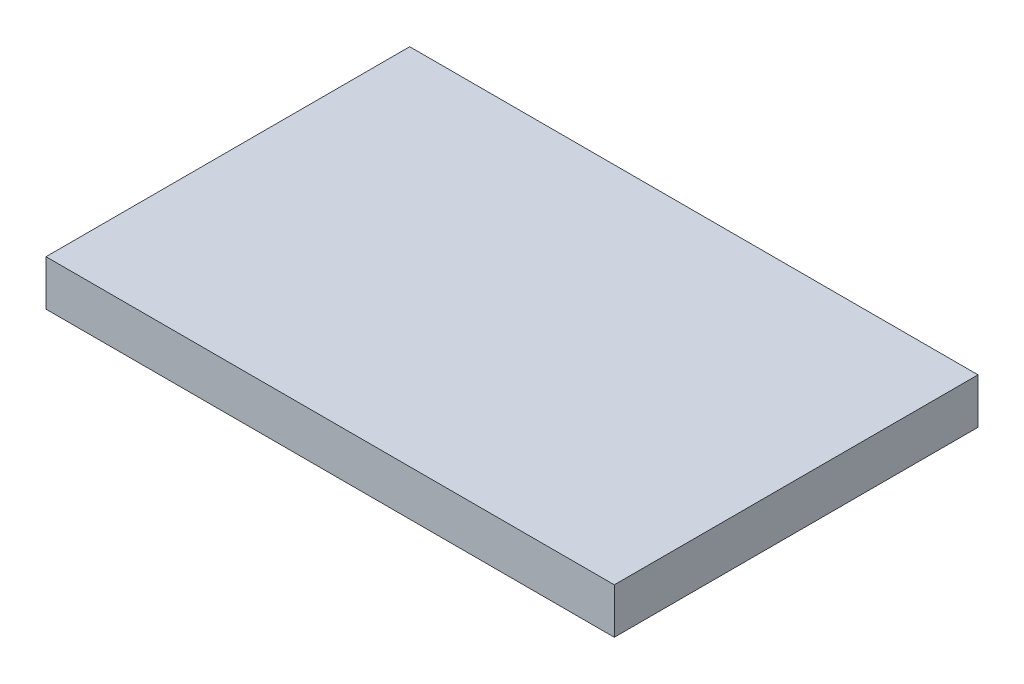
ISO-10303-21;
HEADER;
FILE_DESCRIPTION(('STEP AP214'),'2;1');
FILE_NAME('part.step','',(''),(''),'','','');
FILE_SCHEMA(('AUTOMOTIVE_DESIGN { 1 0 10303 214 1 1 1 1 }'));
ENDSEC;
DATA;
#1=APPLICATION_CONTEXT('core data for automotive mechanical design processes');
#2=APPLICATION_PROTOCOL_DEFINITION('international standard','automotive_design',2000,#1);
#3=PRODUCT_CONTEXT('',#1,'mechanical');
#4=PRODUCT('Part','Part','',(#3));
#5=PRODUCT_RELATED_PRODUCT_CATEGORY('part','',(#4));
#6=PRODUCT_DEFINITION_FORMATION('','',#4);
#7=PRODUCT_DEFINITION_CONTEXT('part definition',#1,'design');
#8=PRODUCT_DEFINITION('design','',#6,#7);
#9=PRODUCT_DEFINITION_SHAPE('','',#8);
#10=(LENGTH_UNIT() NAMED_UNIT(*) SI_UNIT(.MILLI.,.METRE.));
#11=(NAMED_UNIT(*) PLANE_ANGLE_UNIT() SI_UNIT($,.RADIAN.));
#12=(NAMED_UNIT(*) SI_UNIT($,.STERADIAN.) SOLID_ANGLE_UNIT());
#13=UNCERTAINTY_MEASURE_WITH_UNIT(LENGTH_MEASURE(1.E-05),#10,'distance_accuracy_value','');
#14=(GEOMETRIC_REPRESENTATION_CONTEXT(3) GLOBAL_UNCERTAINTY_ASSIGNED_CONTEXT((#13)) GLOBAL_UNIT_ASSIGNED_CONTEXT((#10,
#11,#12)) REPRESENTATION_CONTEXT('',''));
#15=CARTESIAN_POINT('',(0.,0.,0.));
#16=DIRECTION('',(0.,0.,1.));
#17=DIRECTION('',(1.,0.,0.));
#18=AXIS2_PLACEMENT_3D('',#15,#16,#17);
#19=CARTESIAN_POINT('',(185.,350.,406.4));
#20=DIRECTION('',(-1.,0.,0.));
#21=DIRECTION('',(0.,-1.,0.));
#22=AXIS2_PLACEMENT_3D('',#19,#20,#21);
#23=PLANE('',#22);
#24=DIRECTION('',(0.,1.,0.));
#25=VECTOR('',#24,1.);
#26=CARTESIAN_POINT('',(185.,350.,0.));
#27=LINE('',#26,#25);
#28=CARTESIAN_POINT('',(185.,299.2,0.));
#29=VERTEX_POINT('',#28);
#30=CARTESIAN_POINT('',(185.,350.,0.));
#31=VERTEX_POINT('',#30);
#32=EDGE_CURVE('E107',#29,#31,#27,.T.);
#33=ORIENTED_EDGE('',*,*,#32,.T.);
#34=DIRECTION('',(0.,0.,-1.));
#35=VECTOR('',#34,1.);
#36=CARTESIAN_POINT('',(185.,350.,406.4));
#37=LINE('',#36,#35);
#38=CARTESIAN_POINT('',(185.,350.,406.4));
#39=VERTEX_POINT('',#38);
#40=EDGE_CURVE('E11',#39,#31,#37,.T.);
#41=ORIENTED_EDGE('',*,*,#40,.F.);
#42=DIRECTION('',(0.,1.,0.));
#43=VECTOR('',#42,1.);
#44=CARTESIAN_POINT('',(185.,350.,406.4));
#45=LINE('',#44,#43);
#46=CARTESIAN_POINT('',(185.,299.2,406.4));
#47=VERTEX_POINT('',#46);
#48=EDGE_CURVE('E91',#47,#39,#45,.T.);
#49=ORIENTED_EDGE('',*,*,#48,.F.);
#50=DIRECTION('',(0.,0.,-1.));
#51=VECTOR('',#50,1.);
#52=CARTESIAN_POINT('',(185.,299.2,406.4));
#53=LINE('',#52,#51);
#54=EDGE_CURVE('E103',#47,#29,#53,.T.);
#55=ORIENTED_EDGE('',*,*,#54,.T.);
#56=EDGE_LOOP('',(#33,#41,#49,#55));
#57=FACE_BOUND('',#56,.T.);
#58=ADVANCED_FACE('F39',(#57),#23,.F.);
#59=CARTESIAN_POINT('',(185.,350.,406.4));
#60=DIRECTION('',(0.,-1.,0.));
#61=DIRECTION('',(1.,0.,0.));
#62=AXIS2_PLACEMENT_3D('',#59,#60,#61);
#63=PLANE('',#62);
#64=DIRECTION('',(-1.,0.,0.));
#65=VECTOR('',#64,1.);
#66=CARTESIAN_POINT('',(185.,350.,0.));
#67=LINE('',#66,#65);
#68=CARTESIAN_POINT('',(-450.,350.,0.));
#69=VERTEX_POINT('',#68);
#70=EDGE_CURVE('E96',#31,#69,#67,.T.);
#71=ORIENTED_EDGE('',*,*,#70,.T.);
#72=DIRECTION('',(0.,0.,-1.));
#73=VECTOR('',#72,1.);
#74=CARTESIAN_POINT('',(-450.,350.,406.4));
#75=LINE('',#74,#73);
#76=CARTESIAN_POINT('',(-450.,350.,406.4));
#77=VERTEX_POINT('',#76);
#78=EDGE_CURVE('E48',#77,#69,#75,.T.);
#79=ORIENTED_EDGE('',*,*,#78,.F.);
#80=DIRECTION('',(-1.,0.,0.));
#81=VECTOR('',#80,1.);
#82=CARTESIAN_POINT('',(185.,350.,406.4));
#83=LINE('',#82,#81);
#84=EDGE_CURVE('E86',#39,#77,#83,.T.);
#85=ORIENTED_EDGE('',*,*,#84,.F.);
#86=ORIENTED_EDGE('',*,*,#40,.T.);
#87=EDGE_LOOP('',(#71,#79,#85,#86));
#88=FACE_BOUND('',#87,.T.);
#89=ADVANCED_FACE('F95',(#88),#63,.F.);
#90=CARTESIAN_POINT('',(-450.,350.,406.4));
#91=DIRECTION('',(1.,0.,0.));
#92=DIRECTION('',(0.,1.,0.));
#93=AXIS2_PLACEMENT_3D('',#90,#91,#92);
#94=PLANE('',#93);
#95=DIRECTION('',(0.,-1.,0.));
#96=VECTOR('',#95,1.);
#97=CARTESIAN_POINT('',(-450.,350.,0.));
#98=LINE('',#97,#96);
#99=CARTESIAN_POINT('',(-450.,299.2,0.));
#100=VERTEX_POINT('',#99);
#101=EDGE_CURVE('E73',#69,#100,#98,.T.);
#102=ORIENTED_EDGE('',*,*,#101,.T.);
#103=DIRECTION('',(0.,0.,-1.));
#104=VECTOR('',#103,1.);
#105=CARTESIAN_POINT('',(-450.,299.2,406.4));
#106=LINE('',#105,#104);
#107=CARTESIAN_POINT('',(-450.,299.2,406.4));
#108=VERTEX_POINT('',#107);
#109=EDGE_CURVE('E98',#108,#100,#106,.T.);
#110=ORIENTED_EDGE('',*,*,#109,.F.);
#111=DIRECTION('',(0.,-1.,0.));
#112=VECTOR('',#111,1.);
#113=CARTESIAN_POINT('',(-450.,350.,406.4));
#114=LINE('',#113,#112);
#115=EDGE_CURVE('E89',#77,#108,#114,.T.);
#116=ORIENTED_EDGE('',*,*,#115,.F.);
#117=ORIENTED_EDGE('',*,*,#78,.T.);
#118=EDGE_LOOP('',(#102,#110,#116,#117));
#119=FACE_BOUND('',#118,.T.);
#120=ADVANCED_FACE('F99',(#119),#94,.F.);
#121=CARTESIAN_POINT('',(185.,299.2,406.4));
#122=DIRECTION('',(0.,1.,0.));
#123=DIRECTION('',(-1.,0.,0.));
#124=AXIS2_PLACEMENT_3D('',#121,#122,#123);
#125=PLANE('',#124);
#126=DIRECTION('',(1.,0.,0.));
#127=VECTOR('',#126,1.);
#128=CARTESIAN_POINT('',(185.,299.2,0.));
#129=LINE('',#128,#127);
#130=EDGE_CURVE('E79',#100,#29,#129,.T.);
#131=ORIENTED_EDGE('',*,*,#130,.T.);
#132=ORIENTED_EDGE('',*,*,#54,.F.);
#133=DIRECTION('',(1.,0.,0.));
#134=VECTOR('',#133,1.);
#135=CARTESIAN_POINT('',(185.,299.2,406.4));
#136=LINE('',#135,#134);
#137=EDGE_CURVE('E56',#108,#47,#136,.T.);
#138=ORIENTED_EDGE('',*,*,#137,.F.);
#139=ORIENTED_EDGE('',*,*,#109,.T.);
#140=EDGE_LOOP('',(#131,#132,#138,#139));
#141=FACE_BOUND('',#140,.T.);
#142=ADVANCED_FACE('F120',(#141),#125,.F.);
#143=CARTESIAN_POINT('',(0.,0.,406.4));
#144=DIRECTION('',(0.,0.,-1.));
#145=DIRECTION('',(-1.,0.,0.));
#146=AXIS2_PLACEMENT_3D('',#143,#144,#145);
#147=PLANE('',#146);
#148=ORIENTED_EDGE('',*,*,#48,.T.);
#149=ORIENTED_EDGE('',*,*,#84,.T.);
#150=ORIENTED_EDGE('',*,*,#115,.T.);
#151=ORIENTED_EDGE('',*,*,#137,.T.);
#152=EDGE_LOOP('',(#148,#149,#150,#151));
#153=FACE_BOUND('',#152,.T.);
#154=ADVANCED_FACE('F87',(#153),#147,.F.);
#155=CARTESIAN_POINT('',(0.,0.,0.));
#156=DIRECTION('',(0.,0.,-1.));
#157=DIRECTION('',(-1.,0.,0.));
#158=AXIS2_PLACEMENT_3D('',#155,#156,#157);
#159=PLANE('',#158);
#160=ORIENTED_EDGE('',*,*,#32,.F.);
#161=ORIENTED_EDGE('',*,*,#130,.F.);
#162=ORIENTED_EDGE('',*,*,#101,.F.);
#163=ORIENTED_EDGE('',*,*,#70,.F.);
#164=EDGE_LOOP('',(#160,#161,#162,#163));
#165=FACE_BOUND('',#164,.T.);
#166=ADVANCED_FACE('F123',(#165),#159,.T.);
#167=CLOSED_SHELL('',(#58,#89,#120,#142,#154,#166));
#168=MANIFOLD_SOLID_BREP('B2',#167);
#169=ADVANCED_BREP_SHAPE_REPRESENTATION('',(#18,#168),#14);
#170=SHAPE_DEFINITION_REPRESENTATION(#9,#169);
ENDSEC;
END-ISO-10303-21;
